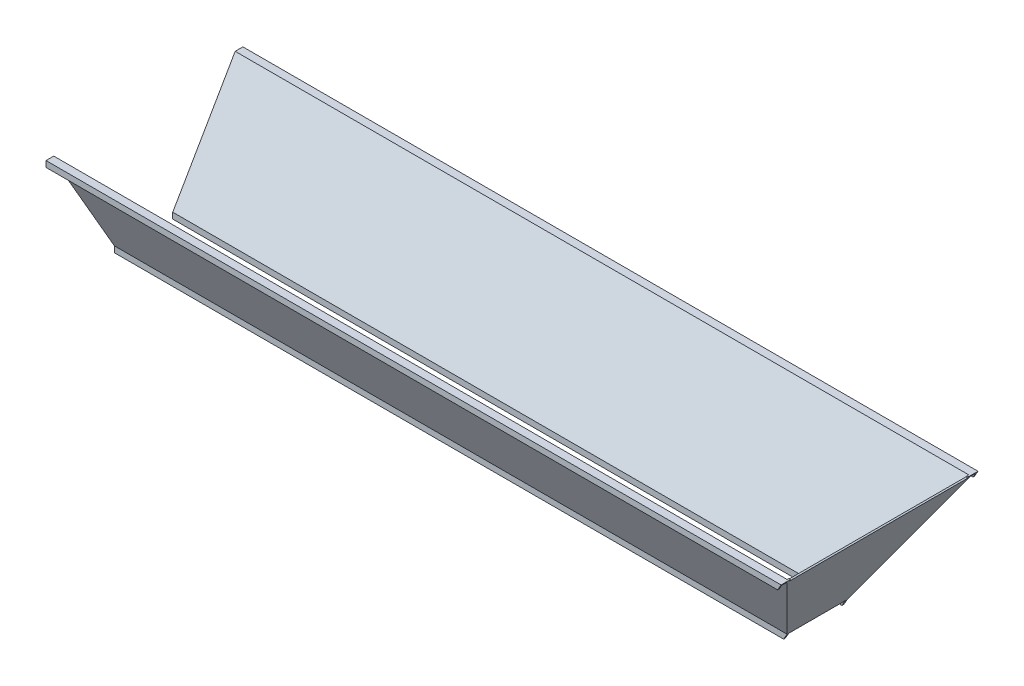
ISO-10303-21;
HEADER;
FILE_DESCRIPTION(('STEP AP214'),'2;1');
FILE_NAME('part.step','',(''),(''),'','','');
FILE_SCHEMA(('AUTOMOTIVE_DESIGN { 1 0 10303 214 1 1 1 1 }'));
ENDSEC;
DATA;
#1=APPLICATION_CONTEXT('core data for automotive mechanical design processes');
#2=APPLICATION_PROTOCOL_DEFINITION('international standard','automotive_design',2000,#1);
#3=PRODUCT_CONTEXT('',#1,'mechanical');
#4=PRODUCT('Part','Part','',(#3));
#5=PRODUCT_RELATED_PRODUCT_CATEGORY('part','',(#4));
#6=PRODUCT_DEFINITION_FORMATION('','',#4);
#7=PRODUCT_DEFINITION_CONTEXT('part definition',#1,'design');
#8=PRODUCT_DEFINITION('design','',#6,#7);
#9=PRODUCT_DEFINITION_SHAPE('','',#8);
#10=(LENGTH_UNIT() NAMED_UNIT(*) SI_UNIT(.MILLI.,.METRE.));
#11=(NAMED_UNIT(*) PLANE_ANGLE_UNIT() SI_UNIT($,.RADIAN.));
#12=(NAMED_UNIT(*) SI_UNIT($,.STERADIAN.) SOLID_ANGLE_UNIT());
#13=UNCERTAINTY_MEASURE_WITH_UNIT(LENGTH_MEASURE(1.E-05),#10,'distance_accuracy_value','');
#14=(GEOMETRIC_REPRESENTATION_CONTEXT(3) GLOBAL_UNCERTAINTY_ASSIGNED_CONTEXT((#13)) GLOBAL_UNIT_ASSIGNED_CONTEXT((#10,
#11,#12)) REPRESENTATION_CONTEXT('',''));
#15=CARTESIAN_POINT('',(0.,0.,0.));
#16=DIRECTION('',(0.,0.,1.));
#17=DIRECTION('',(1.,0.,0.));
#18=AXIS2_PLACEMENT_3D('',#15,#16,#17);
#19=CARTESIAN_POINT('',(0.,0.,127.));
#20=DIRECTION('',(0.,1.,0.));
#21=DIRECTION('',(0.,0.,1.));
#22=AXIS2_PLACEMENT_3D('',#19,#20,#21);
#23=PLANE('',#22);
#24=DIRECTION('',(-1.,0.,0.));
#25=VECTOR('',#24,1.);
#26=CARTESIAN_POINT('',(2865.94973107737,0.,119.667651581292));
#27=LINE('',#26,#25);
#28=CARTESIAN_POINT('',(2844.8,0.,119.667651581292));
#29=VERTEX_POINT('',#28);
#30=CARTESIAN_POINT('',(2837.46765158129,0.,119.667651581292));
#31=VERTEX_POINT('',#30);
#32=EDGE_CURVE('E216',#29,#31,#27,.T.);
#33=ORIENTED_EDGE('',*,*,#32,.T.);
#34=DIRECTION('',(0.,0.,-1.));
#35=VECTOR('',#34,1.);
#36=CARTESIAN_POINT('',(2837.46765158129,0.,127.));
#37=LINE('',#36,#35);
#38=CARTESIAN_POINT('',(2837.46765158129,0.,-119.667651581292));
#39=VERTEX_POINT('',#38);
#40=EDGE_CURVE('E366',#31,#39,#37,.T.);
#41=ORIENTED_EDGE('',*,*,#40,.T.);
#42=DIRECTION('',(-1.,0.,0.));
#43=VECTOR('',#42,1.);
#44=CARTESIAN_POINT('',(2865.94973107737,0.,-119.667651581292));
#45=LINE('',#44,#43);
#46=CARTESIAN_POINT('',(2844.8,0.,-119.667651581292));
#47=VERTEX_POINT('',#46);
#48=EDGE_CURVE('E256',#47,#39,#45,.T.);
#49=ORIENTED_EDGE('',*,*,#48,.F.);
#50=DIRECTION('',(0.,0.,-1.));
#51=VECTOR('',#50,1.);
#52=CARTESIAN_POINT('',(2844.8,0.,127.));
#53=LINE('',#52,#51);
#54=EDGE_CURVE('E40',#29,#47,#53,.T.);
#55=ORIENTED_EDGE('',*,*,#54,.F.);
#56=EDGE_LOOP('',(#33,#41,#49,#55));
#57=FACE_BOUND('',#56,.T.);
#58=ADVANCED_FACE('F36',(#57),#23,.F.);
#59=CARTESIAN_POINT('',(3108.7645430735,457.2,127.));
#60=DIRECTION('',(0.,-1.,0.));
#61=DIRECTION('',(1.,0.,0.));
#62=AXIS2_PLACEMENT_3D('',#59,#60,#61);
#63=PLANE('',#62);
#64=DIRECTION('',(0.,0.,-1.));
#65=VECTOR('',#64,1.);
#66=CARTESIAN_POINT('',(3108.7645430735,457.2,127.));
#67=LINE('',#66,#65);
#68=CARTESIAN_POINT('',(3108.7645430735,457.2,416.364543073493));
#69=VERTEX_POINT('',#68);
#70=CARTESIAN_POINT('',(3108.7645430735,457.2,376.364543073493));
#71=VERTEX_POINT('',#70);
#72=EDGE_CURVE('E389',#69,#71,#67,.T.);
#73=ORIENTED_EDGE('',*,*,#72,.T.);
#74=DIRECTION('',(-1.,0.,0.));
#75=VECTOR('',#74,1.);
#76=CARTESIAN_POINT('',(3108.7645430735,457.2,376.364543073493));
#77=LINE('',#76,#75);
#78=CARTESIAN_POINT('',(3101.43219465479,457.2,376.364543073493));
#79=VERTEX_POINT('',#78);
#80=EDGE_CURVE('E274',#71,#79,#77,.T.);
#81=ORIENTED_EDGE('',*,*,#80,.T.);
#82=DIRECTION('',(0.,0.,-1.));
#83=VECTOR('',#82,1.);
#84=CARTESIAN_POINT('',(3101.43219465479,457.2,127.));
#85=LINE('',#84,#83);
#86=CARTESIAN_POINT('',(3101.43219465479,457.2,383.632194654785));
#87=VERTEX_POINT('',#86);
#88=EDGE_CURVE('E363',#87,#79,#85,.T.);
#89=ORIENTED_EDGE('',*,*,#88,.F.);
#90=DIRECTION('',(-1.,0.,0.));
#91=VECTOR('',#90,1.);
#92=CARTESIAN_POINT('',(3108.7645430735,457.2,383.632194654785));
#93=LINE('',#92,#91);
#94=CARTESIAN_POINT('',(0.,457.2,383.632194654785));
#95=VERTEX_POINT('',#94);
#96=EDGE_CURVE('E353',#87,#95,#93,.T.);
#97=ORIENTED_EDGE('',*,*,#96,.T.);
#98=DIRECTION('',(0.,0.,-1.));
#99=VECTOR('',#98,1.);
#100=CARTESIAN_POINT('',(0.,457.2,127.));
#101=LINE('',#100,#99);
#102=CARTESIAN_POINT('',(0.,457.2,416.364543073493));
#103=VERTEX_POINT('',#102);
#104=EDGE_CURVE('E385',#103,#95,#101,.T.);
#105=ORIENTED_EDGE('',*,*,#104,.F.);
#106=DIRECTION('',(-1.,0.,0.));
#107=VECTOR('',#106,1.);
#108=CARTESIAN_POINT('',(3152.53926520238,457.199999999999,416.364543073493));
#109=LINE('',#108,#107);
#110=EDGE_CURVE('E309',#69,#103,#109,.T.);
#111=ORIENTED_EDGE('',*,*,#110,.F.);
#112=EDGE_LOOP('',(#73,#81,#89,#97,#105,#111));
#113=FACE_BOUND('',#112,.T.);
#114=ADVANCED_FACE('F467',(#113),#63,.F.);
#115=CARTESIAN_POINT('',(3152.53926520238,431.799999999999,416.364543073493));
#116=DIRECTION('',(0.,1.,0.));
#117=DIRECTION('',(-1.,0.,0.));
#118=AXIS2_PLACEMENT_3D('',#115,#116,#117);
#119=PLANE('',#118);
#120=DIRECTION('',(-1.,0.,0.));
#121=VECTOR('',#120,1.);
#122=CARTESIAN_POINT('',(3152.53926520238,431.799999999999,410.014543073493));
#123=LINE('',#122,#121);
#124=CARTESIAN_POINT('',(3094.09984623608,431.799999999999,410.014543073493));
#125=VERTEX_POINT('',#124);
#126=CARTESIAN_POINT('',(0.,431.8,410.014543073493));
#127=VERTEX_POINT('',#126);
#128=EDGE_CURVE('E285',#125,#127,#123,.T.);
#129=ORIENTED_EDGE('',*,*,#128,.F.);
#130=DIRECTION('',(0.,0.,1.));
#131=VECTOR('',#130,1.);
#132=CARTESIAN_POINT('',(3094.09984623608,431.799999999999,416.364543073493));
#133=LINE('',#132,#131);
#134=CARTESIAN_POINT('',(3094.09984623608,431.799999999999,416.364543073493));
#135=VERTEX_POINT('',#134);
#136=EDGE_CURVE('E301',#125,#135,#133,.T.);
#137=ORIENTED_EDGE('',*,*,#136,.T.);
#138=DIRECTION('',(-1.,0.,0.));
#139=VECTOR('',#138,1.);
#140=CARTESIAN_POINT('',(3152.53926520238,431.799999999999,416.364543073493));
#141=LINE('',#140,#139);
#142=CARTESIAN_POINT('',(0.,431.8,416.364543073493));
#143=VERTEX_POINT('',#142);
#144=EDGE_CURVE('E307',#135,#143,#141,.T.);
#145=ORIENTED_EDGE('',*,*,#144,.T.);
#146=DIRECTION('',(0.,0.,-1.));
#147=VECTOR('',#146,1.);
#148=CARTESIAN_POINT('',(0.,431.8,416.364543073493));
#149=LINE('',#148,#147);
#150=EDGE_CURVE('E304',#143,#127,#149,.T.);
#151=ORIENTED_EDGE('',*,*,#150,.T.);
#152=EDGE_LOOP('',(#129,#137,#145,#151));
#153=FACE_BOUND('',#152,.T.);
#154=ADVANCED_FACE('F476',(#153),#119,.F.);
#155=CARTESIAN_POINT('',(3545.54681461024,-7.24229518736899E-13,127.));
#156=DIRECTION('',(0.,-0.499999999999995,0.866025403784442));
#157=DIRECTION('',(0.,-0.866025403784442,-0.499999999999995));
#158=AXIS2_PLACEMENT_3D('',#155,#156,#157);
#159=PLANE('',#158);
#160=DIRECTION('',(-0.447213595499957,-0.774596669241487,-0.447213595499953));
#161=VECTOR('',#160,1.);
#162=CARTESIAN_POINT('',(2984.94936292205,242.745817229398,267.149362922047));
#163=LINE('',#162,#161);
#164=CARTESIAN_POINT('',(3105.09836886414,450.85,387.29836886414));
#165=VERTEX_POINT('',#164);
#166=CARTESIAN_POINT('',(2844.8,0.,127.));
#167=VERTEX_POINT('',#166);
#168=EDGE_CURVE('E378',#165,#167,#163,.T.);
#169=ORIENTED_EDGE('',*,*,#168,.F.);
#170=DIRECTION('',(-1.,0.,0.));
#171=VECTOR('',#170,1.);
#172=CARTESIAN_POINT('',(3108.7645430735,450.85,387.29836886414));
#173=LINE('',#172,#171);
#174=CARTESIAN_POINT('',(0.,450.85,387.298368864139));
#175=VERTEX_POINT('',#174);
#176=EDGE_CURVE('E278',#165,#175,#173,.T.);
#177=ORIENTED_EDGE('',*,*,#176,.T.);
#178=DIRECTION('',(0.,0.866025403784442,0.499999999999995));
#179=VECTOR('',#178,1.);
#180=CARTESIAN_POINT('',(0.,0.,127.));
#181=LINE('',#180,#179);
#182=CARTESIAN_POINT('',(0.,0.,127.));
#183=VERTEX_POINT('',#182);
#184=EDGE_CURVE('E373',#183,#175,#181,.T.);
#185=ORIENTED_EDGE('',*,*,#184,.F.);
#186=DIRECTION('',(1.,0.,0.));
#187=VECTOR('',#186,1.);
#188=CARTESIAN_POINT('',(0.,0.,127.));
#189=LINE('',#188,#187);
#190=EDGE_CURVE('E224',#183,#167,#189,.T.);
#191=ORIENTED_EDGE('',*,*,#190,.T.);
#192=EDGE_LOOP('',(#169,#177,#185,#191));
#193=FACE_BOUND('',#192,.T.);
#194=ADVANCED_FACE('F487',(#193),#159,.T.);
#195=CARTESIAN_POINT('',(3545.54681461024,457.199999999999,-390.964543073493));
#196=DIRECTION('',(0.,-0.499999999999995,-0.866025403784442));
#197=DIRECTION('',(0.,0.866025403784442,-0.499999999999995));
#198=AXIS2_PLACEMENT_3D('',#195,#196,#197);
#199=PLANE('',#198);
#200=DIRECTION('',(0.,-0.866025403784442,0.499999999999995));
#201=VECTOR('',#200,1.);
#202=CARTESIAN_POINT('',(0.,457.2,-390.964543073493));
#203=LINE('',#202,#201);
#204=CARTESIAN_POINT('',(0.,450.85,-387.298368864139));
#205=VERTEX_POINT('',#204);
#206=CARTESIAN_POINT('',(0.,0.,-127.));
#207=VERTEX_POINT('',#206);
#208=EDGE_CURVE('E374',#205,#207,#203,.T.);
#209=ORIENTED_EDGE('',*,*,#208,.F.);
#210=DIRECTION('',(-1.,0.,0.));
#211=VECTOR('',#210,1.);
#212=CARTESIAN_POINT('',(3545.54681461024,450.85,-387.29836886414));
#213=LINE('',#212,#211);
#214=CARTESIAN_POINT('',(3105.09836886414,450.85,-387.29836886414));
#215=VERTEX_POINT('',#214);
#216=EDGE_CURVE('E313',#215,#205,#213,.T.);
#217=ORIENTED_EDGE('',*,*,#216,.F.);
#218=DIRECTION('',(0.447213595499957,0.774596669241486,-0.447213595499954));
#219=VECTOR('',#218,1.);
#220=CARTESIAN_POINT('',(3196.12099738084,608.505817229398,-478.320997380842));
#221=LINE('',#220,#219);
#222=CARTESIAN_POINT('',(2844.8,0.,-127.));
#223=VERTEX_POINT('',#222);
#224=EDGE_CURVE('E371',#223,#215,#221,.T.);
#225=ORIENTED_EDGE('',*,*,#224,.F.);
#226=DIRECTION('',(1.,0.,0.));
#227=VECTOR('',#226,1.);
#228=CARTESIAN_POINT('',(0.,0.,-127.));
#229=LINE('',#228,#227);
#230=EDGE_CURVE('E380',#207,#223,#229,.T.);
#231=ORIENTED_EDGE('',*,*,#230,.F.);
#232=EDGE_LOOP('',(#209,#217,#225,#231));
#233=FACE_BOUND('',#232,.T.);
#234=ADVANCED_FACE('F426',(#233),#199,.T.);
#235=CARTESIAN_POINT('',(0.,457.2,127.));
#236=DIRECTION('',(1.,0.,0.));
#237=DIRECTION('',(0.,1.,0.));
#238=AXIS2_PLACEMENT_3D('',#235,#236,#237);
#239=PLANE('',#238);
#240=DIRECTION('',(0.,0.,-1.));
#241=VECTOR('',#240,1.);
#242=CARTESIAN_POINT('',(0.,450.85,127.));
#243=LINE('',#242,#241);
#244=CARTESIAN_POINT('',(0.,450.85,-410.014543073493));
#245=VERTEX_POINT('',#244);
#246=EDGE_CURVE('E316',#205,#245,#243,.T.);
#247=ORIENTED_EDGE('',*,*,#246,.F.);
#248=ORIENTED_EDGE('',*,*,#208,.T.);
#249=DIRECTION('',(0.,1.,0.));
#250=VECTOR('',#249,1.);
#251=CARTESIAN_POINT('',(0.,-25.4,-127.));
#252=LINE('',#251,#250);
#253=CARTESIAN_POINT('',(0.,-25.4,-127.));
#254=VERTEX_POINT('',#253);
#255=EDGE_CURVE('E243',#254,#207,#252,.T.);
#256=ORIENTED_EDGE('',*,*,#255,.F.);
#257=DIRECTION('',(0.,0.,-1.));
#258=VECTOR('',#257,1.);
#259=CARTESIAN_POINT('',(0.,-25.4,-119.667651581292));
#260=LINE('',#259,#258);
#261=CARTESIAN_POINT('',(0.,-25.4,-119.667651581292));
#262=VERTEX_POINT('',#261);
#263=EDGE_CURVE('E249',#262,#254,#260,.T.);
#264=ORIENTED_EDGE('',*,*,#263,.F.);
#265=DIRECTION('',(0.,-1.,0.));
#266=VECTOR('',#265,1.);
#267=CARTESIAN_POINT('',(0.,0.,-119.667651581292));
#268=LINE('',#267,#266);
#269=CARTESIAN_POINT('',(0.,0.,-119.667651581292));
#270=VERTEX_POINT('',#269);
#271=EDGE_CURVE('E245',#270,#262,#268,.T.);
#272=ORIENTED_EDGE('',*,*,#271,.F.);
#273=DIRECTION('',(0.,-0.866025403784442,0.499999999999995));
#274=VECTOR('',#273,1.);
#275=CARTESIAN_POINT('',(0.,460.375,-385.465281759462));
#276=LINE('',#275,#274);
#277=CARTESIAN_POINT('',(0.,457.2,-383.632194654785));
#278=VERTEX_POINT('',#277);
#279=EDGE_CURVE('E340',#278,#270,#276,.T.);
#280=ORIENTED_EDGE('',*,*,#279,.F.);
#281=CARTESIAN_POINT('',(0.,457.2,-416.364543073493));
#282=VERTEX_POINT('',#281);
#283=EDGE_CURVE('E382',#278,#282,#101,.T.);
#284=ORIENTED_EDGE('',*,*,#283,.T.);
#285=DIRECTION('',(0.,1.,0.));
#286=VECTOR('',#285,1.);
#287=CARTESIAN_POINT('',(0.,457.2,-416.364543073493));
#288=LINE('',#287,#286);
#289=CARTESIAN_POINT('',(0.,431.8,-416.364543073493));
#290=VERTEX_POINT('',#289);
#291=EDGE_CURVE('E342',#290,#282,#288,.T.);
#292=ORIENTED_EDGE('',*,*,#291,.F.);
#293=DIRECTION('',(0.,0.,-1.));
#294=VECTOR('',#293,1.);
#295=CARTESIAN_POINT('',(0.,431.8,-416.364543073493));
#296=LINE('',#295,#294);
#297=CARTESIAN_POINT('',(0.,431.8,-410.014543073493));
#298=VERTEX_POINT('',#297);
#299=EDGE_CURVE('E332',#298,#290,#296,.T.);
#300=ORIENTED_EDGE('',*,*,#299,.F.);
#301=DIRECTION('',(0.,1.,0.));
#302=VECTOR('',#301,1.);
#303=CARTESIAN_POINT('',(0.,457.2,-410.014543073493));
#304=LINE('',#303,#302);
#305=EDGE_CURVE('E300',#298,#245,#304,.T.);
#306=ORIENTED_EDGE('',*,*,#305,.T.);
#307=EDGE_LOOP('',(#247,#248,#256,#264,#272,#280,#284,#292,#300,#306));
#308=FACE_BOUND('',#307,.T.);
#309=ADVANCED_FACE('F38',(#308),#239,.F.);
#310=ORIENTED_EDGE('',*,*,#184,.T.);
#311=DIRECTION('',(0.,0.,-1.));
#312=VECTOR('',#311,1.);
#313=CARTESIAN_POINT('',(0.,450.85,127.));
#314=LINE('',#313,#312);
#315=CARTESIAN_POINT('',(0.,450.85,410.014543073493));
#316=VERTEX_POINT('',#315);
#317=EDGE_CURVE('E281',#316,#175,#314,.T.);
#318=ORIENTED_EDGE('',*,*,#317,.F.);
#319=DIRECTION('',(0.,-1.,0.));
#320=VECTOR('',#319,1.);
#321=CARTESIAN_POINT('',(0.,457.2,410.014543073493));
#322=LINE('',#321,#320);
#323=EDGE_CURVE('E277',#316,#127,#322,.T.);
#324=ORIENTED_EDGE('',*,*,#323,.T.);
#325=ORIENTED_EDGE('',*,*,#150,.F.);
#326=DIRECTION('',(0.,-1.,0.));
#327=VECTOR('',#326,1.);
#328=CARTESIAN_POINT('',(0.,457.2,416.364543073493));
#329=LINE('',#328,#327);
#330=EDGE_CURVE('E289',#103,#143,#329,.T.);
#331=ORIENTED_EDGE('',*,*,#330,.F.);
#332=ORIENTED_EDGE('',*,*,#104,.T.);
#333=DIRECTION('',(0.,0.866025403784442,0.499999999999995));
#334=VECTOR('',#333,1.);
#335=CARTESIAN_POINT('',(0.,3.17499999999997,121.500738685969));
#336=LINE('',#335,#334);
#337=CARTESIAN_POINT('',(0.,0.,119.667651581292));
#338=VERTEX_POINT('',#337);
#339=EDGE_CURVE('E358',#338,#95,#336,.T.);
#340=ORIENTED_EDGE('',*,*,#339,.F.);
#341=DIRECTION('',(0.,1.,0.));
#342=VECTOR('',#341,1.);
#343=CARTESIAN_POINT('',(0.,-25.4,119.667651581292));
#344=LINE('',#343,#342);
#345=CARTESIAN_POINT('',(0.,-25.4,119.667651581292));
#346=VERTEX_POINT('',#345);
#347=EDGE_CURVE('E226',#346,#338,#344,.T.);
#348=ORIENTED_EDGE('',*,*,#347,.F.);
#349=DIRECTION('',(0.,0.,-1.));
#350=VECTOR('',#349,1.);
#351=CARTESIAN_POINT('',(0.,-25.4,127.));
#352=LINE('',#351,#350);
#353=CARTESIAN_POINT('',(0.,-25.4,127.));
#354=VERTEX_POINT('',#353);
#355=EDGE_CURVE('E211',#354,#346,#352,.T.);
#356=ORIENTED_EDGE('',*,*,#355,.F.);
#357=DIRECTION('',(0.,-1.,0.));
#358=VECTOR('',#357,1.);
#359=CARTESIAN_POINT('',(0.,0.,127.));
#360=LINE('',#359,#358);
#361=EDGE_CURVE('E221',#183,#354,#360,.T.);
#362=ORIENTED_EDGE('',*,*,#361,.F.);
#363=EDGE_LOOP('',(#310,#318,#324,#325,#331,#332,#340,#348,#356,#362));
#364=FACE_BOUND('',#363,.T.);
#365=ADVANCED_FACE('F228',(#364),#239,.F.);
#366=CARTESIAN_POINT('',(3101.43219465479,457.2,-376.364543073493));
#367=VERTEX_POINT('',#366);
#368=CARTESIAN_POINT('',(3101.43219465479,457.2,-383.632194654786));
#369=VERTEX_POINT('',#368);
#370=EDGE_CURVE('E357',#367,#369,#85,.T.);
#371=ORIENTED_EDGE('',*,*,#370,.F.);
#372=DIRECTION('',(1.,0.,0.));
#373=VECTOR('',#372,1.);
#374=CARTESIAN_POINT('',(3108.7645430735,457.2,-376.364543073493));
#375=LINE('',#374,#373);
#376=CARTESIAN_POINT('',(3108.7645430735,457.2,-376.364543073493));
#377=VERTEX_POINT('',#376);
#378=EDGE_CURVE('E270',#367,#377,#375,.T.);
#379=ORIENTED_EDGE('',*,*,#378,.T.);
#380=CARTESIAN_POINT('',(3108.7645430735,457.199999999999,-416.364543073493));
#381=VERTEX_POINT('',#380);
#382=EDGE_CURVE('E388',#377,#381,#67,.T.);
#383=ORIENTED_EDGE('',*,*,#382,.T.);
#384=DIRECTION('',(-1.,0.,0.));
#385=VECTOR('',#384,1.);
#386=CARTESIAN_POINT('',(3152.53926520239,457.199999999999,-416.364543073493));
#387=LINE('',#386,#385);
#388=EDGE_CURVE('E345',#381,#282,#387,.T.);
#389=ORIENTED_EDGE('',*,*,#388,.T.);
#390=ORIENTED_EDGE('',*,*,#283,.F.);
#391=DIRECTION('',(-1.,0.,0.));
#392=VECTOR('',#391,1.);
#393=CARTESIAN_POINT('',(3545.54681461024,457.2,-383.632194654786));
#394=LINE('',#393,#392);
#395=EDGE_CURVE('E367',#369,#278,#394,.T.);
#396=ORIENTED_EDGE('',*,*,#395,.F.);
#397=EDGE_LOOP('',(#371,#379,#383,#389,#390,#396));
#398=FACE_BOUND('',#397,.T.);
#399=ADVANCED_FACE('F448',(#398),#63,.F.);
#400=CARTESIAN_POINT('',(2844.8,0.,127.));
#401=DIRECTION('',(-0.86602540378444,0.499999999999998,0.));
#402=DIRECTION('',(-0.499999999999998,-0.86602540378444,0.));
#403=AXIS2_PLACEMENT_3D('',#400,#401,#402);
#404=PLANE('',#403);
#405=DIRECTION('',(0.,0.,-1.));
#406=VECTOR('',#405,1.);
#407=CARTESIAN_POINT('',(3103.7645430735,448.539745962156,-376.364543073493));
#408=LINE('',#407,#406);
#409=CARTESIAN_POINT('',(3103.7645430735,448.539745962156,376.364543073493));
#410=VERTEX_POINT('',#409);
#411=CARTESIAN_POINT('',(3103.7645430735,448.539745962156,-376.364543073493));
#412=VERTEX_POINT('',#411);
#413=EDGE_CURVE('E264',#410,#412,#408,.T.);
#414=ORIENTED_EDGE('',*,*,#413,.F.);
#415=DIRECTION('',(-0.49999999999999,-0.866025403784444,0.));
#416=VECTOR('',#415,1.);
#417=CARTESIAN_POINT('',(3103.7645430735,448.539745962156,376.364543073493));
#418=LINE('',#417,#416);
#419=EDGE_CURVE('E241',#71,#410,#418,.T.);
#420=ORIENTED_EDGE('',*,*,#419,.F.);
#421=ORIENTED_EDGE('',*,*,#72,.F.);
#422=DIRECTION('',(0.499999999999998,0.86602540378444,0.));
#423=VECTOR('',#422,1.);
#424=CARTESIAN_POINT('',(3119.70822360572,476.155010703611,416.364543073493));
#425=LINE('',#424,#423);
#426=EDGE_CURVE('E297',#135,#69,#425,.T.);
#427=ORIENTED_EDGE('',*,*,#426,.F.);
#428=ORIENTED_EDGE('',*,*,#136,.F.);
#429=DIRECTION('',(0.499999999999998,0.86602540378444,0.));
#430=VECTOR('',#429,1.);
#431=CARTESIAN_POINT('',(3119.70822360572,476.155010703611,410.014543073493));
#432=LINE('',#431,#430);
#433=CARTESIAN_POINT('',(3105.09836886414,450.85,410.014543073493));
#434=VERTEX_POINT('',#433);
#435=EDGE_CURVE('E282',#125,#434,#432,.T.);
#436=ORIENTED_EDGE('',*,*,#435,.T.);
#437=DIRECTION('',(0.,0.,-1.));
#438=VECTOR('',#437,1.);
#439=CARTESIAN_POINT('',(3105.09836886414,450.85,127.));
#440=LINE('',#439,#438);
#441=EDGE_CURVE('E286',#434,#165,#440,.T.);
#442=ORIENTED_EDGE('',*,*,#441,.T.);
#443=ORIENTED_EDGE('',*,*,#168,.T.);
#444=DIRECTION('',(0.499999999999998,0.86602540378444,0.));
#445=VECTOR('',#444,1.);
#446=CARTESIAN_POINT('',(2850.08743276934,9.15810219810409,127.));
#447=LINE('',#446,#445);
#448=CARTESIAN_POINT('',(2830.13530316258,-25.4,127.));
#449=VERTEX_POINT('',#448);
#450=EDGE_CURVE('E237',#449,#167,#447,.T.);
#451=ORIENTED_EDGE('',*,*,#450,.F.);
#452=DIRECTION('',(0.,0.,1.));
#453=VECTOR('',#452,1.);
#454=CARTESIAN_POINT('',(2830.13530316258,-25.4,127.));
#455=LINE('',#454,#453);
#456=CARTESIAN_POINT('',(2830.13530316258,-25.4,119.667651581292));
#457=VERTEX_POINT('',#456);
#458=EDGE_CURVE('E213',#457,#449,#455,.T.);
#459=ORIENTED_EDGE('',*,*,#458,.F.);
#460=DIRECTION('',(-0.499999999999998,-0.86602540378444,0.));
#461=VECTOR('',#460,1.);
#462=CARTESIAN_POINT('',(2839.08891014128,-9.89189780189596,119.667651581292));
#463=LINE('',#462,#461);
#464=EDGE_CURVE('E246',#29,#457,#463,.T.);
#465=ORIENTED_EDGE('',*,*,#464,.F.);
#466=ORIENTED_EDGE('',*,*,#54,.T.);
#467=DIRECTION('',(0.499999999999998,0.86602540378444,0.));
#468=VECTOR('',#467,1.);
#469=CARTESIAN_POINT('',(2850.08743276934,9.15810219810409,-119.667651581292));
#470=LINE('',#469,#468);
#471=CARTESIAN_POINT('',(2830.13530316258,-25.4,-119.667651581292));
#472=VERTEX_POINT('',#471);
#473=EDGE_CURVE('E242',#472,#47,#470,.T.);
#474=ORIENTED_EDGE('',*,*,#473,.F.);
#475=DIRECTION('',(0.,0.,1.));
#476=VECTOR('',#475,1.);
#477=CARTESIAN_POINT('',(2830.13530316258,-25.4,-119.667651581292));
#478=LINE('',#477,#476);
#479=CARTESIAN_POINT('',(2830.13530316258,-25.4,-127.));
#480=VERTEX_POINT('',#479);
#481=EDGE_CURVE('E259',#480,#472,#478,.T.);
#482=ORIENTED_EDGE('',*,*,#481,.F.);
#483=DIRECTION('',(-0.499999999999998,-0.86602540378444,0.));
#484=VECTOR('',#483,1.);
#485=CARTESIAN_POINT('',(2839.08891014128,-9.89189780189596,-127.));
#486=LINE('',#485,#484);
#487=EDGE_CURVE('E238',#223,#480,#486,.T.);
#488=ORIENTED_EDGE('',*,*,#487,.F.);
#489=ORIENTED_EDGE('',*,*,#224,.T.);
#490=DIRECTION('',(0.,0.,-1.));
#491=VECTOR('',#490,1.);
#492=CARTESIAN_POINT('',(3105.09836886414,450.85,127.));
#493=LINE('',#492,#491);
#494=CARTESIAN_POINT('',(3105.09836886414,450.85,-410.014543073493));
#495=VERTEX_POINT('',#494);
#496=EDGE_CURVE('E323',#215,#495,#493,.T.);
#497=ORIENTED_EDGE('',*,*,#496,.T.);
#498=DIRECTION('',(-0.499999999999998,-0.86602540378444,0.));
#499=VECTOR('',#498,1.);
#500=CARTESIAN_POINT('',(3119.70822360572,476.155010703612,-410.014543073493));
#501=LINE('',#500,#499);
#502=CARTESIAN_POINT('',(3094.09984623608,431.799999999999,-410.014543073493));
#503=VERTEX_POINT('',#502);
#504=EDGE_CURVE('E317',#495,#503,#501,.T.);
#505=ORIENTED_EDGE('',*,*,#504,.T.);
#506=DIRECTION('',(0.,0.,1.));
#507=VECTOR('',#506,1.);
#508=CARTESIAN_POINT('',(3094.09984623608,431.799999999999,-416.364543073493));
#509=LINE('',#508,#507);
#510=CARTESIAN_POINT('',(3094.09984623608,431.799999999999,-416.364543073493));
#511=VERTEX_POINT('',#510);
#512=EDGE_CURVE('E336',#511,#503,#509,.T.);
#513=ORIENTED_EDGE('',*,*,#512,.F.);
#514=DIRECTION('',(-0.499999999999998,-0.86602540378444,0.));
#515=VECTOR('',#514,1.);
#516=CARTESIAN_POINT('',(3119.70822360572,476.155010703612,-416.364543073493));
#517=LINE('',#516,#515);
#518=EDGE_CURVE('E333',#381,#511,#517,.T.);
#519=ORIENTED_EDGE('',*,*,#518,.F.);
#520=ORIENTED_EDGE('',*,*,#382,.F.);
#521=DIRECTION('',(0.49999999999999,0.866025403784444,0.));
#522=VECTOR('',#521,1.);
#523=CARTESIAN_POINT('',(3108.7645430735,457.2,-376.364543073493));
#524=LINE('',#523,#522);
#525=EDGE_CURVE('E266',#412,#377,#524,.T.);
#526=ORIENTED_EDGE('',*,*,#525,.F.);
#527=EDGE_LOOP('',(#414,#420,#421,#427,#428,#436,#442,#443,#451,#459,#465,#466,#474,#482,#488,
#489,#497,#505,#513,#519,#520,#526));
#528=FACE_BOUND('',#527,.T.);
#529=ADVANCED_FACE('F418',(#528),#404,.F.);
#530=CARTESIAN_POINT('',(2839.30073868597,3.17499999999999,127.));
#531=DIRECTION('',(-0.86602540378444,0.499999999999998,0.));
#532=DIRECTION('',(-0.499999999999998,-0.86602540378444,0.));
#533=AXIS2_PLACEMENT_3D('',#530,#531,#532);
#534=PLANE('',#533);
#535=DIRECTION('',(0.499999999999998,0.86602540378444,0.));
#536=VECTOR('',#535,1.);
#537=CARTESIAN_POINT('',(2839.30073868597,3.17499999999999,376.364543073493));
#538=LINE('',#537,#536);
#539=CARTESIAN_POINT('',(3098.26528175946,451.714745962156,376.364543073493));
#540=VERTEX_POINT('',#539);
#541=EDGE_CURVE('E11',#540,#79,#538,.T.);
#542=ORIENTED_EDGE('',*,*,#541,.F.);
#543=DIRECTION('',(0.,0.,1.));
#544=VECTOR('',#543,1.);
#545=CARTESIAN_POINT('',(3098.26528175946,451.714745962156,127.));
#546=LINE('',#545,#544);
#547=CARTESIAN_POINT('',(3098.26528175946,451.714745962156,-376.364543073493));
#548=VERTEX_POINT('',#547);
#549=EDGE_CURVE('E393',#548,#540,#546,.T.);
#550=ORIENTED_EDGE('',*,*,#549,.F.);
#551=DIRECTION('',(-0.499999999999998,-0.86602540378444,0.));
#552=VECTOR('',#551,1.);
#553=CARTESIAN_POINT('',(2839.30073868597,3.17500000000241,-376.364543073496));
#554=LINE('',#553,#552);
#555=EDGE_CURVE('E46',#367,#548,#554,.T.);
#556=ORIENTED_EDGE('',*,*,#555,.F.);
#557=ORIENTED_EDGE('',*,*,#370,.T.);
#558=DIRECTION('',(0.447213595499957,0.774596669241486,-0.447213595499954));
#559=VECTOR('',#558,1.);
#560=CARTESIAN_POINT('',(3191.72158832962,613.585817229398,-473.921588329617));
#561=LINE('',#560,#559);
#562=EDGE_CURVE('E360',#39,#369,#561,.T.);
#563=ORIENTED_EDGE('',*,*,#562,.F.);
#564=ORIENTED_EDGE('',*,*,#40,.F.);
#565=DIRECTION('',(-0.447213595499957,-0.774596669241487,-0.447213595499953));
#566=VECTOR('',#565,1.);
#567=CARTESIAN_POINT('',(2980.54995387082,247.825817229398,262.749953870822));
#568=LINE('',#567,#566);
#569=EDGE_CURVE('E350',#87,#31,#568,.T.);
#570=ORIENTED_EDGE('',*,*,#569,.F.);
#571=ORIENTED_EDGE('',*,*,#88,.T.);
#572=EDGE_LOOP('',(#542,#550,#556,#557,#563,#564,#570,#571));
#573=FACE_BOUND('',#572,.T.);
#574=ADVANCED_FACE('F457',(#573),#534,.T.);
#575=CARTESIAN_POINT('',(3545.54681461024,3.17499999999924,121.500738685969));
#576=DIRECTION('',(0.,-0.499999999999995,0.866025403784442));
#577=DIRECTION('',(0.,-0.866025403784442,-0.499999999999995));
#578=AXIS2_PLACEMENT_3D('',#575,#576,#577);
#579=PLANE('',#578);
#580=ORIENTED_EDGE('',*,*,#569,.T.);
#581=DIRECTION('',(1.,0.,0.));
#582=VECTOR('',#581,1.);
#583=CARTESIAN_POINT('',(0.,0.,119.667651581292));
#584=LINE('',#583,#582);
#585=EDGE_CURVE('E354',#338,#31,#584,.T.);
#586=ORIENTED_EDGE('',*,*,#585,.F.);
#587=ORIENTED_EDGE('',*,*,#339,.T.);
#588=ORIENTED_EDGE('',*,*,#96,.F.);
#589=EDGE_LOOP('',(#580,#586,#587,#588));
#590=FACE_BOUND('',#589,.T.);
#591=ADVANCED_FACE('F525',(#590),#579,.F.);
#592=CARTESIAN_POINT('',(3545.54681461024,460.374999999999,-385.465281759462));
#593=DIRECTION('',(0.,-0.499999999999995,-0.866025403784442));
#594=DIRECTION('',(0.,0.866025403784442,-0.499999999999995));
#595=AXIS2_PLACEMENT_3D('',#592,#593,#594);
#596=PLANE('',#595);
#597=ORIENTED_EDGE('',*,*,#562,.T.);
#598=ORIENTED_EDGE('',*,*,#395,.T.);
#599=ORIENTED_EDGE('',*,*,#279,.T.);
#600=DIRECTION('',(1.,0.,0.));
#601=VECTOR('',#600,1.);
#602=CARTESIAN_POINT('',(3545.54681461024,0.,-119.667651581292));
#603=LINE('',#602,#601);
#604=EDGE_CURVE('E352',#270,#39,#603,.T.);
#605=ORIENTED_EDGE('',*,*,#604,.T.);
#606=EDGE_LOOP('',(#597,#598,#599,#605));
#607=FACE_BOUND('',#606,.T.);
#608=ADVANCED_FACE('F497',(#607),#596,.F.);
#609=CARTESIAN_POINT('',(3152.53926520239,457.199999999999,-416.364543073493));
#610=DIRECTION('',(0.,0.,1.));
#611=DIRECTION('',(1.,0.,0.));
#612=AXIS2_PLACEMENT_3D('',#609,#610,#611);
#613=PLANE('',#612);
#614=ORIENTED_EDGE('',*,*,#388,.F.);
#615=ORIENTED_EDGE('',*,*,#518,.T.);
#616=DIRECTION('',(-1.,0.,0.));
#617=VECTOR('',#616,1.);
#618=CARTESIAN_POINT('',(3152.53926520239,431.799999999999,-416.364543073493));
#619=LINE('',#618,#617);
#620=EDGE_CURVE('E337',#511,#290,#619,.T.);
#621=ORIENTED_EDGE('',*,*,#620,.T.);
#622=ORIENTED_EDGE('',*,*,#291,.T.);
#623=EDGE_LOOP('',(#614,#615,#621,#622));
#624=FACE_BOUND('',#623,.T.);
#625=ADVANCED_FACE('F442',(#624),#613,.F.);
#626=CARTESIAN_POINT('',(3152.53926520239,431.799999999999,-416.364543073493));
#627=DIRECTION('',(0.,1.,0.));
#628=DIRECTION('',(-1.,0.,0.));
#629=AXIS2_PLACEMENT_3D('',#626,#627,#628);
#630=PLANE('',#629);
#631=ORIENTED_EDGE('',*,*,#512,.T.);
#632=DIRECTION('',(-1.,0.,0.));
#633=VECTOR('',#632,1.);
#634=CARTESIAN_POINT('',(3152.53926520239,431.799999999999,-410.014543073493));
#635=LINE('',#634,#633);
#636=EDGE_CURVE('E321',#503,#298,#635,.T.);
#637=ORIENTED_EDGE('',*,*,#636,.T.);
#638=ORIENTED_EDGE('',*,*,#299,.T.);
#639=ORIENTED_EDGE('',*,*,#620,.F.);
#640=EDGE_LOOP('',(#631,#637,#638,#639));
#641=FACE_BOUND('',#640,.T.);
#642=ADVANCED_FACE('F439',(#641),#630,.F.);
#643=CARTESIAN_POINT('',(3108.7645430735,450.85,127.));
#644=DIRECTION('',(0.,-1.,0.));
#645=DIRECTION('',(1.,0.,0.));
#646=AXIS2_PLACEMENT_3D('',#643,#644,#645);
#647=PLANE('',#646);
#648=ORIENTED_EDGE('',*,*,#216,.T.);
#649=ORIENTED_EDGE('',*,*,#246,.T.);
#650=DIRECTION('',(-1.,0.,0.));
#651=VECTOR('',#650,1.);
#652=CARTESIAN_POINT('',(3108.7645430735,450.85,-410.014543073493));
#653=LINE('',#652,#651);
#654=EDGE_CURVE('E318',#495,#245,#653,.T.);
#655=ORIENTED_EDGE('',*,*,#654,.F.);
#656=ORIENTED_EDGE('',*,*,#496,.F.);
#657=EDGE_LOOP('',(#648,#649,#655,#656));
#658=FACE_BOUND('',#657,.T.);
#659=ADVANCED_FACE('F430',(#658),#647,.T.);
#660=CARTESIAN_POINT('',(3152.53926520239,457.199999999999,-410.014543073493));
#661=DIRECTION('',(0.,0.,1.));
#662=DIRECTION('',(1.,0.,0.));
#663=AXIS2_PLACEMENT_3D('',#660,#661,#662);
#664=PLANE('',#663);
#665=ORIENTED_EDGE('',*,*,#654,.T.);
#666=ORIENTED_EDGE('',*,*,#305,.F.);
#667=ORIENTED_EDGE('',*,*,#636,.F.);
#668=ORIENTED_EDGE('',*,*,#504,.F.);
#669=EDGE_LOOP('',(#665,#666,#667,#668));
#670=FACE_BOUND('',#669,.T.);
#671=ADVANCED_FACE('F433',(#670),#664,.T.);
#672=CARTESIAN_POINT('',(3152.53926520238,457.199999999999,416.364543073493));
#673=DIRECTION('',(0.,0.,-1.));
#674=DIRECTION('',(-1.,0.,0.));
#675=AXIS2_PLACEMENT_3D('',#672,#673,#674);
#676=PLANE('',#675);
#677=ORIENTED_EDGE('',*,*,#144,.F.);
#678=ORIENTED_EDGE('',*,*,#426,.T.);
#679=ORIENTED_EDGE('',*,*,#110,.T.);
#680=ORIENTED_EDGE('',*,*,#330,.T.);
#681=EDGE_LOOP('',(#677,#678,#679,#680));
#682=FACE_BOUND('',#681,.T.);
#683=ADVANCED_FACE('F472',(#682),#676,.F.);
#684=CARTESIAN_POINT('',(3108.7645430735,450.85,127.));
#685=DIRECTION('',(0.,-1.,0.));
#686=DIRECTION('',(1.,0.,0.));
#687=AXIS2_PLACEMENT_3D('',#684,#685,#686);
#688=PLANE('',#687);
#689=ORIENTED_EDGE('',*,*,#441,.F.);
#690=DIRECTION('',(-1.,0.,0.));
#691=VECTOR('',#690,1.);
#692=CARTESIAN_POINT('',(3152.53926520238,450.85,410.014543073493));
#693=LINE('',#692,#691);
#694=EDGE_CURVE('E283',#434,#316,#693,.T.);
#695=ORIENTED_EDGE('',*,*,#694,.T.);
#696=ORIENTED_EDGE('',*,*,#317,.T.);
#697=ORIENTED_EDGE('',*,*,#176,.F.);
#698=EDGE_LOOP('',(#689,#695,#696,#697));
#699=FACE_BOUND('',#698,.T.);
#700=ADVANCED_FACE('F485',(#699),#688,.T.);
#701=CARTESIAN_POINT('',(3152.53926520238,457.199999999999,410.014543073493));
#702=DIRECTION('',(0.,0.,-1.));
#703=DIRECTION('',(-1.,0.,0.));
#704=AXIS2_PLACEMENT_3D('',#701,#702,#703);
#705=PLANE('',#704);
#706=ORIENTED_EDGE('',*,*,#128,.T.);
#707=ORIENTED_EDGE('',*,*,#323,.F.);
#708=ORIENTED_EDGE('',*,*,#694,.F.);
#709=ORIENTED_EDGE('',*,*,#435,.F.);
#710=EDGE_LOOP('',(#706,#707,#708,#709));
#711=FACE_BOUND('',#710,.T.);
#712=ADVANCED_FACE('F480',(#711),#705,.T.);
#713=CARTESIAN_POINT('',(3095.10428903565,453.539745962156,376.364543073493));
#714=DIRECTION('',(0.,0.,1.));
#715=DIRECTION('',(1.,0.,0.));
#716=AXIS2_PLACEMENT_3D('',#713,#714,#715);
#717=PLANE('',#716);
#718=ORIENTED_EDGE('',*,*,#419,.T.);
#719=DIRECTION('',(0.86602540378444,-0.499999999999998,0.));
#720=VECTOR('',#719,1.);
#721=CARTESIAN_POINT('',(3095.10428903565,453.539745962156,376.364543073493));
#722=LINE('',#721,#720);
#723=EDGE_CURVE('E268',#540,#410,#722,.T.);
#724=ORIENTED_EDGE('',*,*,#723,.F.);
#725=ORIENTED_EDGE('',*,*,#541,.T.);
#726=ORIENTED_EDGE('',*,*,#80,.F.);
#727=EDGE_LOOP('',(#718,#724,#725,#726));
#728=FACE_BOUND('',#727,.T.);
#729=ADVANCED_FACE('F462',(#728),#717,.F.);
#730=CARTESIAN_POINT('',(3100.10428903565,462.2,-376.364543073493));
#731=DIRECTION('',(0.,0.,-1.));
#732=DIRECTION('',(0.,1.,0.));
#733=AXIS2_PLACEMENT_3D('',#730,#731,#732);
#734=PLANE('',#733);
#735=ORIENTED_EDGE('',*,*,#555,.T.);
#736=DIRECTION('',(0.86602540378444,-0.499999999999998,0.));
#737=VECTOR('',#736,1.);
#738=CARTESIAN_POINT('',(3095.10428903565,453.539745962156,-376.364543073493));
#739=LINE('',#738,#737);
#740=EDGE_CURVE('E61',#548,#412,#739,.T.);
#741=ORIENTED_EDGE('',*,*,#740,.T.);
#742=ORIENTED_EDGE('',*,*,#525,.T.);
#743=ORIENTED_EDGE('',*,*,#378,.F.);
#744=EDGE_LOOP('',(#735,#741,#742,#743));
#745=FACE_BOUND('',#744,.T.);
#746=ADVANCED_FACE('F453',(#745),#734,.F.);
#747=CARTESIAN_POINT('',(3095.10428903565,453.539745962156,-376.364543073493));
#748=DIRECTION('',(-0.499999999999998,-0.86602540378444,0.));
#749=DIRECTION('',(0.86602540378444,-0.499999999999998,0.));
#750=AXIS2_PLACEMENT_3D('',#747,#748,#749);
#751=PLANE('',#750);
#752=ORIENTED_EDGE('',*,*,#549,.T.);
#753=ORIENTED_EDGE('',*,*,#723,.T.);
#754=ORIENTED_EDGE('',*,*,#413,.T.);
#755=ORIENTED_EDGE('',*,*,#740,.F.);
#756=EDGE_LOOP('',(#752,#753,#754,#755));
#757=FACE_BOUND('',#756,.T.);
#758=ADVANCED_FACE('F460',(#757),#751,.F.);
#759=CARTESIAN_POINT('',(2865.94973107737,-25.4,-119.667651581292));
#760=DIRECTION('',(0.,1.,0.));
#761=DIRECTION('',(0.,0.,1.));
#762=AXIS2_PLACEMENT_3D('',#759,#760,#761);
#763=PLANE('',#762);
#764=DIRECTION('',(-1.,0.,0.));
#765=VECTOR('',#764,1.);
#766=CARTESIAN_POINT('',(2865.94973107737,-25.4,-127.));
#767=LINE('',#766,#765);
#768=EDGE_CURVE('E252',#480,#254,#767,.T.);
#769=ORIENTED_EDGE('',*,*,#768,.F.);
#770=ORIENTED_EDGE('',*,*,#481,.T.);
#771=DIRECTION('',(-1.,0.,0.));
#772=VECTOR('',#771,1.);
#773=CARTESIAN_POINT('',(2865.94973107737,-25.4,-119.667651581292));
#774=LINE('',#773,#772);
#775=EDGE_CURVE('E254',#472,#262,#774,.T.);
#776=ORIENTED_EDGE('',*,*,#775,.T.);
#777=ORIENTED_EDGE('',*,*,#263,.T.);
#778=EDGE_LOOP('',(#769,#770,#776,#777));
#779=FACE_BOUND('',#778,.T.);
#780=ADVANCED_FACE('F415',(#779),#763,.F.);
#781=CARTESIAN_POINT('',(2865.94973107737,0.,-119.667651581292));
#782=DIRECTION('',(0.,0.,-1.));
#783=DIRECTION('',(-1.,0.,0.));
#784=AXIS2_PLACEMENT_3D('',#781,#782,#783);
#785=PLANE('',#784);
#786=ORIENTED_EDGE('',*,*,#775,.F.);
#787=ORIENTED_EDGE('',*,*,#473,.T.);
#788=ORIENTED_EDGE('',*,*,#48,.T.);
#789=ORIENTED_EDGE('',*,*,#604,.F.);
#790=ORIENTED_EDGE('',*,*,#271,.T.);
#791=EDGE_LOOP('',(#786,#787,#788,#789,#790));
#792=FACE_BOUND('',#791,.T.);
#793=ADVANCED_FACE('F500',(#792),#785,.F.);
#794=CARTESIAN_POINT('',(2865.94973107737,-25.4,-127.));
#795=DIRECTION('',(0.,0.,1.));
#796=DIRECTION('',(1.,0.,0.));
#797=AXIS2_PLACEMENT_3D('',#794,#795,#796);
#798=PLANE('',#797);
#799=ORIENTED_EDGE('',*,*,#230,.T.);
#800=ORIENTED_EDGE('',*,*,#487,.T.);
#801=ORIENTED_EDGE('',*,*,#768,.T.);
#802=ORIENTED_EDGE('',*,*,#255,.T.);
#803=EDGE_LOOP('',(#799,#800,#801,#802));
#804=FACE_BOUND('',#803,.T.);
#805=ADVANCED_FACE('F420',(#804),#798,.F.);
#806=CARTESIAN_POINT('',(2865.94973107737,-25.4,127.));
#807=DIRECTION('',(0.,1.,0.));
#808=DIRECTION('',(0.,0.,1.));
#809=AXIS2_PLACEMENT_3D('',#806,#807,#808);
#810=PLANE('',#809);
#811=DIRECTION('',(-1.,0.,0.));
#812=VECTOR('',#811,1.);
#813=CARTESIAN_POINT('',(2865.94973107737,-25.4,119.667651581292));
#814=LINE('',#813,#812);
#815=EDGE_CURVE('E217',#457,#346,#814,.T.);
#816=ORIENTED_EDGE('',*,*,#815,.F.);
#817=ORIENTED_EDGE('',*,*,#458,.T.);
#818=DIRECTION('',(-1.,0.,0.));
#819=VECTOR('',#818,1.);
#820=CARTESIAN_POINT('',(2865.94973107737,-25.4,127.));
#821=LINE('',#820,#819);
#822=EDGE_CURVE('E206',#449,#354,#821,.T.);
#823=ORIENTED_EDGE('',*,*,#822,.T.);
#824=ORIENTED_EDGE('',*,*,#355,.T.);
#825=EDGE_LOOP('',(#816,#817,#823,#824));
#826=FACE_BOUND('',#825,.T.);
#827=ADVANCED_FACE('F209',(#826),#810,.F.);
#828=CARTESIAN_POINT('',(2865.94973107737,0.,127.));
#829=DIRECTION('',(0.,0.,-1.));
#830=DIRECTION('',(-1.,0.,0.));
#831=AXIS2_PLACEMENT_3D('',#828,#829,#830);
#832=PLANE('',#831);
#833=ORIENTED_EDGE('',*,*,#822,.F.);
#834=ORIENTED_EDGE('',*,*,#450,.T.);
#835=ORIENTED_EDGE('',*,*,#190,.F.);
#836=ORIENTED_EDGE('',*,*,#361,.T.);
#837=EDGE_LOOP('',(#833,#834,#835,#836));
#838=FACE_BOUND('',#837,.T.);
#839=ADVANCED_FACE('F222',(#838),#832,.F.);
#840=CARTESIAN_POINT('',(2865.94973107737,-25.4,119.667651581292));
#841=DIRECTION('',(0.,0.,1.));
#842=DIRECTION('',(1.,0.,0.));
#843=AXIS2_PLACEMENT_3D('',#840,#841,#842);
#844=PLANE('',#843);
#845=ORIENTED_EDGE('',*,*,#32,.F.);
#846=ORIENTED_EDGE('',*,*,#464,.T.);
#847=ORIENTED_EDGE('',*,*,#815,.T.);
#848=ORIENTED_EDGE('',*,*,#347,.T.);
#849=ORIENTED_EDGE('',*,*,#585,.T.);
#850=EDGE_LOOP('',(#845,#846,#847,#848,#849));
#851=FACE_BOUND('',#850,.T.);
#852=ADVANCED_FACE('F493',(#851),#844,.F.);
#853=CLOSED_SHELL('',(#58,#114,#154,#194,#234,#309,#365,#399,#529,#574,#591,#608,#625,#642,#659,
#671,#683,#700,#712,#729,#746,#758,#780,#793,#805,#827,#839,#852));
#854=MANIFOLD_SOLID_BREP('B2',#853);
#855=ADVANCED_BREP_SHAPE_REPRESENTATION('',(#18,#854),#14);
#856=SHAPE_DEFINITION_REPRESENTATION(#9,#855);
ENDSEC;
END-ISO-10303-21;
